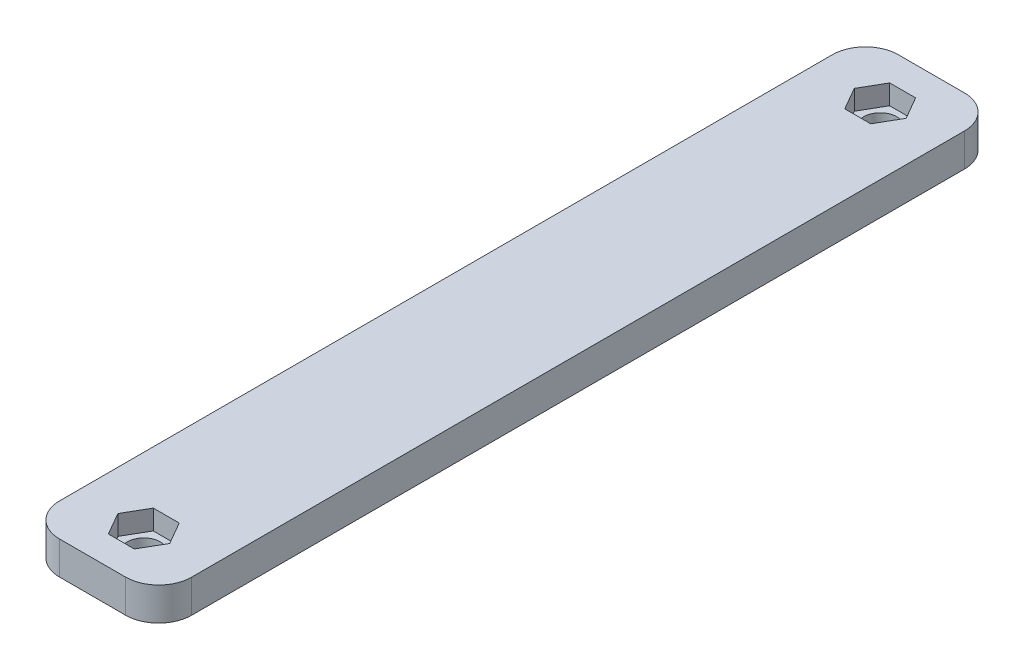
ISO-10303-21;
HEADER;
FILE_DESCRIPTION(('STEP AP214'),'2;1');
FILE_NAME('part.step','',(''),(''),'','','');
FILE_SCHEMA(('AUTOMOTIVE_DESIGN { 1 0 10303 214 1 1 1 1 }'));
ENDSEC;
DATA;
#1=APPLICATION_CONTEXT('core data for automotive mechanical design processes');
#2=APPLICATION_PROTOCOL_DEFINITION('international standard','automotive_design',2000,#1);
#3=PRODUCT_CONTEXT('',#1,'mechanical');
#4=PRODUCT('Part','Part','',(#3));
#5=PRODUCT_RELATED_PRODUCT_CATEGORY('part','',(#4));
#6=PRODUCT_DEFINITION_FORMATION('','',#4);
#7=PRODUCT_DEFINITION_CONTEXT('part definition',#1,'design');
#8=PRODUCT_DEFINITION('design','',#6,#7);
#9=PRODUCT_DEFINITION_SHAPE('','',#8);
#10=(LENGTH_UNIT() NAMED_UNIT(*) SI_UNIT(.MILLI.,.METRE.));
#11=(NAMED_UNIT(*) PLANE_ANGLE_UNIT() SI_UNIT($,.RADIAN.));
#12=(NAMED_UNIT(*) SI_UNIT($,.STERADIAN.) SOLID_ANGLE_UNIT());
#13=UNCERTAINTY_MEASURE_WITH_UNIT(LENGTH_MEASURE(1.E-05),#10,'distance_accuracy_value','');
#14=(GEOMETRIC_REPRESENTATION_CONTEXT(3) GLOBAL_UNCERTAINTY_ASSIGNED_CONTEXT((#13)) GLOBAL_UNIT_ASSIGNED_CONTEXT((#10,
#11,#12)) REPRESENTATION_CONTEXT('',''));
#15=CARTESIAN_POINT('',(0.,0.,0.));
#16=DIRECTION('',(0.,0.,1.));
#17=DIRECTION('',(1.,0.,0.));
#18=AXIS2_PLACEMENT_3D('',#15,#16,#17);
#19=CARTESIAN_POINT('',(0.,5.,0.));
#20=DIRECTION('',(0.,-1.,0.));
#21=DIRECTION('',(0.,0.,-1.));
#22=AXIS2_PLACEMENT_3D('',#19,#20,#21);
#23=PLANE('',#22);
#24=DIRECTION('',(-1.,0.,0.));
#25=VECTOR('',#24,1.);
#26=CARTESIAN_POINT('',(-10.,5.,-63.5));
#27=LINE('',#26,#25);
#28=CARTESIAN_POINT('',(5.,5.,-63.5));
#29=VERTEX_POINT('',#28);
#30=CARTESIAN_POINT('',(-5.,5.,-63.5));
#31=VERTEX_POINT('',#30);
#32=EDGE_CURVE('E335',#29,#31,#27,.T.);
#33=ORIENTED_EDGE('',*,*,#32,.T.);
#34=CARTESIAN_POINT('',(-5.,5.,-58.5));
#35=DIRECTION('',(0.,-1.,0.));
#36=DIRECTION('',(0.,0.,-1.));
#37=AXIS2_PLACEMENT_3D('',#34,#35,#36);
#38=CIRCLE('',#37,5.);
#39=CARTESIAN_POINT('',(-10.,5.,-58.5));
#40=VERTEX_POINT('',#39);
#41=EDGE_CURVE('E393',#31,#40,#38,.F.);
#42=ORIENTED_EDGE('',*,*,#41,.T.);
#43=DIRECTION('',(0.,0.,1.));
#44=VECTOR('',#43,1.);
#45=CARTESIAN_POINT('',(-10.,5.,63.5));
#46=LINE('',#45,#44);
#47=CARTESIAN_POINT('',(-10.,5.,58.5));
#48=VERTEX_POINT('',#47);
#49=EDGE_CURVE('E340',#40,#48,#46,.T.);
#50=ORIENTED_EDGE('',*,*,#49,.T.);
#51=CARTESIAN_POINT('',(-5.,5.,58.5));
#52=DIRECTION('',(0.,-1.,0.));
#53=DIRECTION('',(0.,0.,-1.));
#54=AXIS2_PLACEMENT_3D('',#51,#52,#53);
#55=CIRCLE('',#54,5.);
#56=CARTESIAN_POINT('',(-5.,5.,63.5));
#57=VERTEX_POINT('',#56);
#58=EDGE_CURVE('E60',#48,#57,#55,.F.);
#59=ORIENTED_EDGE('',*,*,#58,.T.);
#60=DIRECTION('',(1.,0.,0.));
#61=VECTOR('',#60,1.);
#62=CARTESIAN_POINT('',(-10.,5.,63.5));
#63=LINE('',#62,#61);
#64=CARTESIAN_POINT('',(5.,5.,63.5));
#65=VERTEX_POINT('',#64);
#66=EDGE_CURVE('E343',#57,#65,#63,.T.);
#67=ORIENTED_EDGE('',*,*,#66,.T.);
#68=CARTESIAN_POINT('',(5.,5.,58.5));
#69=DIRECTION('',(0.,-1.,0.));
#70=DIRECTION('',(0.,0.,-1.));
#71=AXIS2_PLACEMENT_3D('',#68,#69,#70);
#72=CIRCLE('',#71,5.);
#73=CARTESIAN_POINT('',(10.,5.,58.5));
#74=VERTEX_POINT('',#73);
#75=EDGE_CURVE('E387',#65,#74,#72,.F.);
#76=ORIENTED_EDGE('',*,*,#75,.T.);
#77=DIRECTION('',(0.,0.,-1.));
#78=VECTOR('',#77,1.);
#79=CARTESIAN_POINT('',(10.,5.,63.5));
#80=LINE('',#79,#78);
#81=CARTESIAN_POINT('',(10.,5.,-58.5));
#82=VERTEX_POINT('',#81);
#83=EDGE_CURVE('E331',#74,#82,#80,.T.);
#84=ORIENTED_EDGE('',*,*,#83,.T.);
#85=CARTESIAN_POINT('',(5.,5.,-58.5));
#86=DIRECTION('',(0.,-1.,0.));
#87=DIRECTION('',(0.,0.,-1.));
#88=AXIS2_PLACEMENT_3D('',#85,#86,#87);
#89=CIRCLE('',#88,5.);
#90=EDGE_CURVE('E390',#82,#29,#89,.F.);
#91=ORIENTED_EDGE('',*,*,#90,.T.);
#92=EDGE_LOOP('',(#33,#42,#50,#59,#67,#76,#84,#91));
#93=FACE_BOUND('',#92,.T.);
#94=DIRECTION('',(-0.5,0.,-0.866025403784439));
#95=VECTOR('',#94,1.);
#96=CARTESIAN_POINT('',(3.92598183048946,5.,-55.75));
#97=LINE('',#96,#95);
#98=CARTESIAN_POINT('',(3.92598183048946,5.,-55.75));
#99=VERTEX_POINT('',#98);
#100=CARTESIAN_POINT('',(1.96299091524473,5.,-59.15));
#101=VERTEX_POINT('',#100);
#102=EDGE_CURVE('E293',#99,#101,#97,.T.);
#103=ORIENTED_EDGE('',*,*,#102,.F.);
#104=DIRECTION('',(0.5,0.,-0.866025403784439));
#105=VECTOR('',#104,1.);
#106=CARTESIAN_POINT('',(1.96299091524473,5.,-52.35));
#107=LINE('',#106,#105);
#108=CARTESIAN_POINT('',(1.96299091524473,5.,-52.35));
#109=VERTEX_POINT('',#108);
#110=EDGE_CURVE('E261',#109,#99,#107,.T.);
#111=ORIENTED_EDGE('',*,*,#110,.F.);
#112=DIRECTION('',(1.,0.,0.));
#113=VECTOR('',#112,1.);
#114=CARTESIAN_POINT('',(-1.96299091524473,5.,-52.35));
#115=LINE('',#114,#113);
#116=CARTESIAN_POINT('',(-1.96299091524473,5.,-52.35));
#117=VERTEX_POINT('',#116);
#118=EDGE_CURVE('E270',#117,#109,#115,.T.);
#119=ORIENTED_EDGE('',*,*,#118,.F.);
#120=DIRECTION('',(0.5,0.,0.866025403784439));
#121=VECTOR('',#120,1.);
#122=CARTESIAN_POINT('',(-3.92598183048946,5.,-55.75));
#123=LINE('',#122,#121);
#124=CARTESIAN_POINT('',(-3.92598183048946,5.,-55.75));
#125=VERTEX_POINT('',#124);
#126=EDGE_CURVE('E305',#125,#117,#123,.T.);
#127=ORIENTED_EDGE('',*,*,#126,.F.);
#128=DIRECTION('',(-0.5,0.,0.866025403784439));
#129=VECTOR('',#128,1.);
#130=CARTESIAN_POINT('',(-1.96299091524473,5.,-59.15));
#131=LINE('',#130,#129);
#132=CARTESIAN_POINT('',(-1.96299091524473,5.,-59.15));
#133=VERTEX_POINT('',#132);
#134=EDGE_CURVE('E301',#133,#125,#131,.T.);
#135=ORIENTED_EDGE('',*,*,#134,.F.);
#136=DIRECTION('',(-1.,0.,0.));
#137=VECTOR('',#136,1.);
#138=CARTESIAN_POINT('',(1.96299091524473,5.,-59.15));
#139=LINE('',#138,#137);
#140=EDGE_CURVE('E297',#101,#133,#139,.T.);
#141=ORIENTED_EDGE('',*,*,#140,.F.);
#142=EDGE_LOOP('',(#103,#111,#119,#127,#135,#141));
#143=FACE_BOUND('',#142,.T.);
#144=DIRECTION('',(0.5,0.,0.866025403784439));
#145=VECTOR('',#144,1.);
#146=CARTESIAN_POINT('',(1.96299091524473,5.,52.35));
#147=LINE('',#146,#145);
#148=CARTESIAN_POINT('',(1.96299091524473,5.,52.35));
#149=VERTEX_POINT('',#148);
#150=CARTESIAN_POINT('',(3.92598183048946,5.,55.75));
#151=VERTEX_POINT('',#150);
#152=EDGE_CURVE('E198',#149,#151,#147,.T.);
#153=ORIENTED_EDGE('',*,*,#152,.T.);
#154=DIRECTION('',(-0.5,0.,0.866025403784439));
#155=VECTOR('',#154,1.);
#156=CARTESIAN_POINT('',(3.92598183048946,5.,55.75));
#157=LINE('',#156,#155);
#158=CARTESIAN_POINT('',(1.96299091524473,5.,59.15));
#159=VERTEX_POINT('',#158);
#160=EDGE_CURVE('E205',#151,#159,#157,.T.);
#161=ORIENTED_EDGE('',*,*,#160,.T.);
#162=DIRECTION('',(-1.,0.,0.));
#163=VECTOR('',#162,1.);
#164=CARTESIAN_POINT('',(1.96299091524473,5.,59.15));
#165=LINE('',#164,#163);
#166=CARTESIAN_POINT('',(-1.96299091524473,5.,59.15));
#167=VERTEX_POINT('',#166);
#168=EDGE_CURVE('E209',#159,#167,#165,.T.);
#169=ORIENTED_EDGE('',*,*,#168,.T.);
#170=DIRECTION('',(-0.5,0.,-0.866025403784439));
#171=VECTOR('',#170,1.);
#172=CARTESIAN_POINT('',(-1.96299091524473,5.,59.15));
#173=LINE('',#172,#171);
#174=CARTESIAN_POINT('',(-3.92598183048946,5.,55.75));
#175=VERTEX_POINT('',#174);
#176=EDGE_CURVE('E235',#167,#175,#173,.T.);
#177=ORIENTED_EDGE('',*,*,#176,.T.);
#178=DIRECTION('',(0.5,0.,-0.866025403784439));
#179=VECTOR('',#178,1.);
#180=CARTESIAN_POINT('',(-3.92598183048946,5.,55.75));
#181=LINE('',#180,#179);
#182=CARTESIAN_POINT('',(-1.96299091524473,5.,52.35));
#183=VERTEX_POINT('',#182);
#184=EDGE_CURVE('E231',#175,#183,#181,.T.);
#185=ORIENTED_EDGE('',*,*,#184,.T.);
#186=DIRECTION('',(1.,0.,0.));
#187=VECTOR('',#186,1.);
#188=CARTESIAN_POINT('',(-1.96299091524473,5.,52.35));
#189=LINE('',#188,#187);
#190=EDGE_CURVE('E227',#183,#149,#189,.T.);
#191=ORIENTED_EDGE('',*,*,#190,.T.);
#192=EDGE_LOOP('',(#153,#161,#169,#177,#185,#191));
#193=FACE_BOUND('',#192,.T.);
#194=ADVANCED_FACE('F39',(#93,#143,#193),#23,.F.);
#195=CARTESIAN_POINT('',(10.,5.,63.5));
#196=DIRECTION('',(-1.,0.,0.));
#197=DIRECTION('',(0.,0.,1.));
#198=AXIS2_PLACEMENT_3D('',#195,#196,#197);
#199=PLANE('',#198);
#200=DIRECTION('',(0.,0.,-1.));
#201=VECTOR('',#200,1.);
#202=CARTESIAN_POINT('',(10.,0.,63.5));
#203=LINE('',#202,#201);
#204=CARTESIAN_POINT('',(10.,0.,58.5));
#205=VERTEX_POINT('',#204);
#206=CARTESIAN_POINT('',(10.,0.,-58.5));
#207=VERTEX_POINT('',#206);
#208=EDGE_CURVE('E315',#205,#207,#203,.T.);
#209=ORIENTED_EDGE('',*,*,#208,.T.);
#210=DIRECTION('',(0.,-1.,0.));
#211=VECTOR('',#210,1.);
#212=CARTESIAN_POINT('',(10.,5.,-58.5));
#213=LINE('',#212,#211);
#214=EDGE_CURVE('E400',#207,#82,#213,.F.);
#215=ORIENTED_EDGE('',*,*,#214,.T.);
#216=ORIENTED_EDGE('',*,*,#83,.F.);
#217=DIRECTION('',(0.,-1.,0.));
#218=VECTOR('',#217,1.);
#219=CARTESIAN_POINT('',(10.,5.,58.5));
#220=LINE('',#219,#218);
#221=EDGE_CURVE('E396',#74,#205,#220,.T.);
#222=ORIENTED_EDGE('',*,*,#221,.T.);
#223=EDGE_LOOP('',(#209,#215,#216,#222));
#224=FACE_BOUND('',#223,.T.);
#225=ADVANCED_FACE('F418',(#224),#199,.F.);
#226=CARTESIAN_POINT('',(-10.,5.,-63.5));
#227=DIRECTION('',(0.,0.,1.));
#228=DIRECTION('',(1.,0.,0.));
#229=AXIS2_PLACEMENT_3D('',#226,#227,#228);
#230=PLANE('',#229);
#231=DIRECTION('',(-1.,0.,0.));
#232=VECTOR('',#231,1.);
#233=CARTESIAN_POINT('',(-10.,0.,-63.5));
#234=LINE('',#233,#232);
#235=CARTESIAN_POINT('',(5.,0.,-63.5));
#236=VERTEX_POINT('',#235);
#237=CARTESIAN_POINT('',(-5.,0.,-63.5));
#238=VERTEX_POINT('',#237);
#239=EDGE_CURVE('E350',#236,#238,#234,.T.);
#240=ORIENTED_EDGE('',*,*,#239,.T.);
#241=DIRECTION('',(0.,-1.,0.));
#242=VECTOR('',#241,1.);
#243=CARTESIAN_POINT('',(-5.,5.,-63.5));
#244=LINE('',#243,#242);
#245=EDGE_CURVE('E382',#238,#31,#244,.F.);
#246=ORIENTED_EDGE('',*,*,#245,.T.);
#247=ORIENTED_EDGE('',*,*,#32,.F.);
#248=DIRECTION('',(0.,-1.,0.));
#249=VECTOR('',#248,1.);
#250=CARTESIAN_POINT('',(5.,5.,-63.5));
#251=LINE('',#250,#249);
#252=EDGE_CURVE('E378',#29,#236,#251,.T.);
#253=ORIENTED_EDGE('',*,*,#252,.T.);
#254=EDGE_LOOP('',(#240,#246,#247,#253));
#255=FACE_BOUND('',#254,.T.);
#256=ADVANCED_FACE('F428',(#255),#230,.F.);
#257=CARTESIAN_POINT('',(-10.,5.,63.5));
#258=DIRECTION('',(1.,0.,0.));
#259=DIRECTION('',(0.,0.,-1.));
#260=AXIS2_PLACEMENT_3D('',#257,#258,#259);
#261=PLANE('',#260);
#262=ORIENTED_EDGE('',*,*,#49,.F.);
#263=DIRECTION('',(0.,-1.,0.));
#264=VECTOR('',#263,1.);
#265=CARTESIAN_POINT('',(-10.,5.,-58.5));
#266=LINE('',#265,#264);
#267=CARTESIAN_POINT('',(-10.,0.,-58.5));
#268=VERTEX_POINT('',#267);
#269=EDGE_CURVE('E362',#40,#268,#266,.T.);
#270=ORIENTED_EDGE('',*,*,#269,.T.);
#271=DIRECTION('',(0.,0.,1.));
#272=VECTOR('',#271,1.);
#273=CARTESIAN_POINT('',(-10.,0.,63.5));
#274=LINE('',#273,#272);
#275=CARTESIAN_POINT('',(-10.,0.,58.5));
#276=VERTEX_POINT('',#275);
#277=EDGE_CURVE('E354',#268,#276,#274,.T.);
#278=ORIENTED_EDGE('',*,*,#277,.T.);
#279=DIRECTION('',(0.,-1.,0.));
#280=VECTOR('',#279,1.);
#281=CARTESIAN_POINT('',(-10.,5.,58.5));
#282=LINE('',#281,#280);
#283=EDGE_CURVE('E346',#276,#48,#282,.F.);
#284=ORIENTED_EDGE('',*,*,#283,.T.);
#285=EDGE_LOOP('',(#262,#270,#278,#284));
#286=FACE_BOUND('',#285,.T.);
#287=ADVANCED_FACE('F436',(#286),#261,.F.);
#288=CARTESIAN_POINT('',(-10.,5.,63.5));
#289=DIRECTION('',(0.,0.,-1.));
#290=DIRECTION('',(-1.,0.,0.));
#291=AXIS2_PLACEMENT_3D('',#288,#289,#290);
#292=PLANE('',#291);
#293=DIRECTION('',(1.,0.,0.));
#294=VECTOR('',#293,1.);
#295=CARTESIAN_POINT('',(-10.,0.,63.5));
#296=LINE('',#295,#294);
#297=CARTESIAN_POINT('',(-5.,0.,63.5));
#298=VERTEX_POINT('',#297);
#299=CARTESIAN_POINT('',(5.,0.,63.5));
#300=VERTEX_POINT('',#299);
#301=EDGE_CURVE('E336',#298,#300,#296,.T.);
#302=ORIENTED_EDGE('',*,*,#301,.T.);
#303=DIRECTION('',(0.,-1.,0.));
#304=VECTOR('',#303,1.);
#305=CARTESIAN_POINT('',(5.,5.,63.5));
#306=LINE('',#305,#304);
#307=EDGE_CURVE('E11',#300,#65,#306,.F.);
#308=ORIENTED_EDGE('',*,*,#307,.T.);
#309=ORIENTED_EDGE('',*,*,#66,.F.);
#310=DIRECTION('',(0.,-1.,0.));
#311=VECTOR('',#310,1.);
#312=CARTESIAN_POINT('',(-5.,5.,63.5));
#313=LINE('',#312,#311);
#314=EDGE_CURVE('E48',#57,#298,#313,.T.);
#315=ORIENTED_EDGE('',*,*,#314,.T.);
#316=EDGE_LOOP('',(#302,#308,#309,#315));
#317=FACE_BOUND('',#316,.T.);
#318=ADVANCED_FACE('F406',(#317),#292,.F.);
#319=CARTESIAN_POINT('',(0.,0.,0.));
#320=DIRECTION('',(0.,-1.,0.));
#321=DIRECTION('',(0.,0.,-1.));
#322=AXIS2_PLACEMENT_3D('',#319,#320,#321);
#323=PLANE('',#322);
#324=CARTESIAN_POINT('',(0.,0.,55.75));
#325=DIRECTION('',(0.,-1.,0.));
#326=DIRECTION('',(0.,0.,-1.));
#327=AXIS2_PLACEMENT_3D('',#324,#325,#326);
#328=CIRCLE('',#327,2.5);
#329=CARTESIAN_POINT('',(0.,0.,53.25));
#330=VERTEX_POINT('',#329);
#331=EDGE_CURVE('E228',#330,#330,#328,.T.);
#332=ORIENTED_EDGE('',*,*,#331,.F.);
#333=EDGE_LOOP('',(#332));
#334=FACE_BOUND('',#333,.T.);
#335=CARTESIAN_POINT('',(0.,0.,-55.75));
#336=DIRECTION('',(0.,1.,0.));
#337=DIRECTION('',(0.,0.,1.));
#338=AXIS2_PLACEMENT_3D('',#335,#336,#337);
#339=CIRCLE('',#338,2.5);
#340=CARTESIAN_POINT('',(0.,0.,-53.25));
#341=VERTEX_POINT('',#340);
#342=EDGE_CURVE('E257',#341,#341,#339,.T.);
#343=ORIENTED_EDGE('',*,*,#342,.T.);
#344=EDGE_LOOP('',(#343));
#345=FACE_BOUND('',#344,.T.);
#346=ORIENTED_EDGE('',*,*,#277,.F.);
#347=CARTESIAN_POINT('',(-5.,0.,-58.5));
#348=DIRECTION('',(0.,-1.,0.));
#349=DIRECTION('',(0.,0.,-1.));
#350=AXIS2_PLACEMENT_3D('',#347,#348,#349);
#351=CIRCLE('',#350,5.);
#352=EDGE_CURVE('E375',#268,#238,#351,.T.);
#353=ORIENTED_EDGE('',*,*,#352,.T.);
#354=ORIENTED_EDGE('',*,*,#239,.F.);
#355=CARTESIAN_POINT('',(5.,0.,-58.5));
#356=DIRECTION('',(0.,-1.,0.));
#357=DIRECTION('',(0.,0.,-1.));
#358=AXIS2_PLACEMENT_3D('',#355,#356,#357);
#359=CIRCLE('',#358,5.);
#360=EDGE_CURVE('E372',#236,#207,#359,.T.);
#361=ORIENTED_EDGE('',*,*,#360,.T.);
#362=ORIENTED_EDGE('',*,*,#208,.F.);
#363=CARTESIAN_POINT('',(5.,0.,58.5));
#364=DIRECTION('',(0.,-1.,0.));
#365=DIRECTION('',(0.,0.,-1.));
#366=AXIS2_PLACEMENT_3D('',#363,#364,#365);
#367=CIRCLE('',#366,5.);
#368=EDGE_CURVE('E369',#205,#300,#367,.T.);
#369=ORIENTED_EDGE('',*,*,#368,.T.);
#370=ORIENTED_EDGE('',*,*,#301,.F.);
#371=CARTESIAN_POINT('',(-5.,0.,58.5));
#372=DIRECTION('',(0.,-1.,0.));
#373=DIRECTION('',(0.,0.,-1.));
#374=AXIS2_PLACEMENT_3D('',#371,#372,#373);
#375=CIRCLE('',#374,5.);
#376=EDGE_CURVE('E366',#298,#276,#375,.T.);
#377=ORIENTED_EDGE('',*,*,#376,.T.);
#378=EDGE_LOOP('',(#346,#353,#354,#361,#362,#369,#370,#377));
#379=FACE_BOUND('',#378,.T.);
#380=ADVANCED_FACE('F410',(#334,#345,#379),#323,.T.);
#381=CARTESIAN_POINT('',(1.96299091524473,2.,-52.35));
#382=DIRECTION('',(0.866025403784439,0.,0.5));
#383=DIRECTION('',(0.5,0.,-0.866025403784439));
#384=AXIS2_PLACEMENT_3D('',#381,#382,#383);
#385=PLANE('',#384);
#386=ORIENTED_EDGE('',*,*,#110,.T.);
#387=DIRECTION('',(0.,1.,0.));
#388=VECTOR('',#387,1.);
#389=CARTESIAN_POINT('',(3.92598183048946,2.,-55.75));
#390=LINE('',#389,#388);
#391=CARTESIAN_POINT('',(3.92598183048946,2.,-55.75));
#392=VERTEX_POINT('',#391);
#393=EDGE_CURVE('E290',#392,#99,#390,.T.);
#394=ORIENTED_EDGE('',*,*,#393,.F.);
#395=DIRECTION('',(0.5,0.,-0.866025403784439));
#396=VECTOR('',#395,1.);
#397=CARTESIAN_POINT('',(1.96299091524473,2.,-52.35));
#398=LINE('',#397,#396);
#399=CARTESIAN_POINT('',(1.96299091524473,2.,-52.35));
#400=VERTEX_POINT('',#399);
#401=EDGE_CURVE('E265',#400,#392,#398,.T.);
#402=ORIENTED_EDGE('',*,*,#401,.F.);
#403=DIRECTION('',(0.,1.,0.));
#404=VECTOR('',#403,1.);
#405=CARTESIAN_POINT('',(1.96299091524473,2.,-52.35));
#406=LINE('',#405,#404);
#407=EDGE_CURVE('E312',#400,#109,#406,.T.);
#408=ORIENTED_EDGE('',*,*,#407,.T.);
#409=EDGE_LOOP('',(#386,#394,#402,#408));
#410=FACE_BOUND('',#409,.T.);
#411=ADVANCED_FACE('F450',(#410),#385,.F.);
#412=CARTESIAN_POINT('',(-1.96299091524473,2.,-52.35));
#413=DIRECTION('',(0.,0.,1.));
#414=DIRECTION('',(1.,0.,0.));
#415=AXIS2_PLACEMENT_3D('',#412,#413,#414);
#416=PLANE('',#415);
#417=ORIENTED_EDGE('',*,*,#118,.T.);
#418=ORIENTED_EDGE('',*,*,#407,.F.);
#419=DIRECTION('',(1.,0.,0.));
#420=VECTOR('',#419,1.);
#421=CARTESIAN_POINT('',(-1.96299091524473,2.,-52.35));
#422=LINE('',#421,#420);
#423=CARTESIAN_POINT('',(-1.96299091524473,2.,-52.35));
#424=VERTEX_POINT('',#423);
#425=EDGE_CURVE('E286',#424,#400,#422,.T.);
#426=ORIENTED_EDGE('',*,*,#425,.F.);
#427=DIRECTION('',(0.,1.,0.));
#428=VECTOR('',#427,1.);
#429=CARTESIAN_POINT('',(-1.96299091524473,2.,-52.35));
#430=LINE('',#429,#428);
#431=EDGE_CURVE('E316',#424,#117,#430,.T.);
#432=ORIENTED_EDGE('',*,*,#431,.T.);
#433=EDGE_LOOP('',(#417,#418,#426,#432));
#434=FACE_BOUND('',#433,.T.);
#435=ADVANCED_FACE('F610',(#434),#416,.F.);
#436=CARTESIAN_POINT('',(-3.92598183048946,2.,-55.75));
#437=DIRECTION('',(-0.866025403784439,0.,0.5));
#438=DIRECTION('',(0.5,0.,0.866025403784439));
#439=AXIS2_PLACEMENT_3D('',#436,#437,#438);
#440=PLANE('',#439);
#441=ORIENTED_EDGE('',*,*,#126,.T.);
#442=ORIENTED_EDGE('',*,*,#431,.F.);
#443=DIRECTION('',(0.5,0.,0.866025403784439));
#444=VECTOR('',#443,1.);
#445=CARTESIAN_POINT('',(-3.92598183048946,2.,-55.75));
#446=LINE('',#445,#444);
#447=CARTESIAN_POINT('',(-3.92598183048946,2.,-55.75));
#448=VERTEX_POINT('',#447);
#449=EDGE_CURVE('E282',#448,#424,#446,.T.);
#450=ORIENTED_EDGE('',*,*,#449,.F.);
#451=DIRECTION('',(0.,1.,0.));
#452=VECTOR('',#451,1.);
#453=CARTESIAN_POINT('',(-3.92598183048946,2.,-55.75));
#454=LINE('',#453,#452);
#455=EDGE_CURVE('E319',#448,#125,#454,.T.);
#456=ORIENTED_EDGE('',*,*,#455,.T.);
#457=EDGE_LOOP('',(#441,#442,#450,#456));
#458=FACE_BOUND('',#457,.T.);
#459=ADVANCED_FACE('F601',(#458),#440,.F.);
#460=CARTESIAN_POINT('',(-1.96299091524473,2.,-59.15));
#461=DIRECTION('',(-0.866025403784439,0.,-0.5));
#462=DIRECTION('',(-0.5,0.,0.866025403784439));
#463=AXIS2_PLACEMENT_3D('',#460,#461,#462);
#464=PLANE('',#463);
#465=ORIENTED_EDGE('',*,*,#134,.T.);
#466=ORIENTED_EDGE('',*,*,#455,.F.);
#467=DIRECTION('',(-0.5,0.,0.866025403784439));
#468=VECTOR('',#467,1.);
#469=CARTESIAN_POINT('',(-1.96299091524473,2.,-59.15));
#470=LINE('',#469,#468);
#471=CARTESIAN_POINT('',(-1.96299091524473,2.,-59.15));
#472=VERTEX_POINT('',#471);
#473=EDGE_CURVE('E278',#472,#448,#470,.T.);
#474=ORIENTED_EDGE('',*,*,#473,.F.);
#475=DIRECTION('',(0.,1.,0.));
#476=VECTOR('',#475,1.);
#477=CARTESIAN_POINT('',(-1.96299091524473,2.,-59.15));
#478=LINE('',#477,#476);
#479=EDGE_CURVE('E322',#472,#133,#478,.T.);
#480=ORIENTED_EDGE('',*,*,#479,.T.);
#481=EDGE_LOOP('',(#465,#466,#474,#480));
#482=FACE_BOUND('',#481,.T.);
#483=ADVANCED_FACE('F592',(#482),#464,.F.);
#484=CARTESIAN_POINT('',(1.96299091524473,2.,-59.15));
#485=DIRECTION('',(0.,0.,-1.));
#486=DIRECTION('',(-1.,0.,0.));
#487=AXIS2_PLACEMENT_3D('',#484,#485,#486);
#488=PLANE('',#487);
#489=ORIENTED_EDGE('',*,*,#140,.T.);
#490=ORIENTED_EDGE('',*,*,#479,.F.);
#491=DIRECTION('',(-1.,0.,0.));
#492=VECTOR('',#491,1.);
#493=CARTESIAN_POINT('',(1.96299091524473,2.,-59.15));
#494=LINE('',#493,#492);
#495=CARTESIAN_POINT('',(1.96299091524473,2.,-59.15));
#496=VERTEX_POINT('',#495);
#497=EDGE_CURVE('E274',#496,#472,#494,.T.);
#498=ORIENTED_EDGE('',*,*,#497,.F.);
#499=DIRECTION('',(0.,1.,0.));
#500=VECTOR('',#499,1.);
#501=CARTESIAN_POINT('',(1.96299091524473,2.,-59.15));
#502=LINE('',#501,#500);
#503=EDGE_CURVE('E325',#496,#101,#502,.T.);
#504=ORIENTED_EDGE('',*,*,#503,.T.);
#505=EDGE_LOOP('',(#489,#490,#498,#504));
#506=FACE_BOUND('',#505,.T.);
#507=ADVANCED_FACE('F584',(#506),#488,.F.);
#508=CARTESIAN_POINT('',(3.92598183048946,2.,-55.75));
#509=DIRECTION('',(0.866025403784439,0.,-0.5));
#510=DIRECTION('',(-0.5,0.,-0.866025403784439));
#511=AXIS2_PLACEMENT_3D('',#508,#509,#510);
#512=PLANE('',#511);
#513=ORIENTED_EDGE('',*,*,#102,.T.);
#514=ORIENTED_EDGE('',*,*,#503,.F.);
#515=DIRECTION('',(-0.5,0.,-0.866025403784439));
#516=VECTOR('',#515,1.);
#517=CARTESIAN_POINT('',(3.92598183048946,2.,-55.75));
#518=LINE('',#517,#516);
#519=EDGE_CURVE('E269',#392,#496,#518,.T.);
#520=ORIENTED_EDGE('',*,*,#519,.F.);
#521=ORIENTED_EDGE('',*,*,#393,.T.);
#522=EDGE_LOOP('',(#513,#514,#520,#521));
#523=FACE_BOUND('',#522,.T.);
#524=ADVANCED_FACE('F575',(#523),#512,.F.);
#525=CARTESIAN_POINT('',(0.,2.,0.));
#526=DIRECTION('',(0.,1.,0.));
#527=DIRECTION('',(0.,0.,1.));
#528=AXIS2_PLACEMENT_3D('',#525,#526,#527);
#529=PLANE('',#528);
#530=CARTESIAN_POINT('',(0.,2.,-55.75));
#531=DIRECTION('',(0.,1.,0.));
#532=DIRECTION('',(0.,0.,1.));
#533=AXIS2_PLACEMENT_3D('',#530,#531,#532);
#534=CIRCLE('',#533,2.5);
#535=CARTESIAN_POINT('',(0.,2.,-53.25));
#536=VERTEX_POINT('',#535);
#537=EDGE_CURVE('E245',#536,#536,#534,.T.);
#538=ORIENTED_EDGE('',*,*,#537,.F.);
#539=EDGE_LOOP('',(#538));
#540=FACE_BOUND('',#539,.T.);
#541=ORIENTED_EDGE('',*,*,#401,.T.);
#542=ORIENTED_EDGE('',*,*,#519,.T.);
#543=ORIENTED_EDGE('',*,*,#497,.T.);
#544=ORIENTED_EDGE('',*,*,#473,.T.);
#545=ORIENTED_EDGE('',*,*,#449,.T.);
#546=ORIENTED_EDGE('',*,*,#425,.T.);
#547=EDGE_LOOP('',(#541,#542,#543,#544,#545,#546));
#548=FACE_BOUND('',#547,.T.);
#549=ADVANCED_FACE('F566',(#540,#548),#529,.T.);
#550=CARTESIAN_POINT('',(0.,0.,-55.75));
#551=DIRECTION('',(0.,1.,0.));
#552=DIRECTION('',(0.,0.,1.));
#553=AXIS2_PLACEMENT_3D('',#550,#551,#552);
#554=CYLINDRICAL_SURFACE('',#553,2.5);
#555=ORIENTED_EDGE('',*,*,#342,.F.);
#556=EDGE_LOOP('',(#555));
#557=FACE_BOUND('',#556,.T.);
#558=ORIENTED_EDGE('',*,*,#537,.T.);
#559=EDGE_LOOP('',(#558));
#560=FACE_BOUND('',#559,.T.);
#561=ADVANCED_FACE('F553',(#557,#560),#554,.F.);
#562=CARTESIAN_POINT('',(1.96299091524473,2.,52.35));
#563=DIRECTION('',(-0.866025403784439,0.,0.5));
#564=DIRECTION('',(0.5,0.,0.866025403784439));
#565=AXIS2_PLACEMENT_3D('',#562,#563,#564);
#566=PLANE('',#565);
#567=ORIENTED_EDGE('',*,*,#152,.F.);
#568=DIRECTION('',(0.,1.,0.));
#569=VECTOR('',#568,1.);
#570=CARTESIAN_POINT('',(1.96299091524473,2.,52.35));
#571=LINE('',#570,#569);
#572=CARTESIAN_POINT('',(1.96299091524473,2.,52.35));
#573=VERTEX_POINT('',#572);
#574=EDGE_CURVE('E182',#573,#149,#571,.T.);
#575=ORIENTED_EDGE('',*,*,#574,.F.);
#576=DIRECTION('',(0.5,0.,0.866025403784439));
#577=VECTOR('',#576,1.);
#578=CARTESIAN_POINT('',(1.96299091524473,2.,52.35));
#579=LINE('',#578,#577);
#580=CARTESIAN_POINT('',(3.92598183048946,2.,55.75));
#581=VERTEX_POINT('',#580);
#582=EDGE_CURVE('E190',#573,#581,#579,.T.);
#583=ORIENTED_EDGE('',*,*,#582,.T.);
#584=DIRECTION('',(0.,1.,0.));
#585=VECTOR('',#584,1.);
#586=CARTESIAN_POINT('',(3.92598183048946,2.,55.75));
#587=LINE('',#586,#585);
#588=EDGE_CURVE('E242',#581,#151,#587,.T.);
#589=ORIENTED_EDGE('',*,*,#588,.T.);
#590=EDGE_LOOP('',(#567,#575,#583,#589));
#591=FACE_BOUND('',#590,.T.);
#592=ADVANCED_FACE('F194',(#591),#566,.T.);
#593=CARTESIAN_POINT('',(3.92598183048946,2.,55.75));
#594=DIRECTION('',(-0.866025403784439,0.,-0.5));
#595=DIRECTION('',(-0.5,0.,0.866025403784439));
#596=AXIS2_PLACEMENT_3D('',#593,#594,#595);
#597=PLANE('',#596);
#598=ORIENTED_EDGE('',*,*,#160,.F.);
#599=ORIENTED_EDGE('',*,*,#588,.F.);
#600=DIRECTION('',(-0.5,0.,0.866025403784439));
#601=VECTOR('',#600,1.);
#602=CARTESIAN_POINT('',(3.92598183048946,2.,55.75));
#603=LINE('',#602,#601);
#604=CARTESIAN_POINT('',(1.96299091524473,2.,59.15));
#605=VERTEX_POINT('',#604);
#606=EDGE_CURVE('E200',#581,#605,#603,.T.);
#607=ORIENTED_EDGE('',*,*,#606,.T.);
#608=DIRECTION('',(0.,1.,0.));
#609=VECTOR('',#608,1.);
#610=CARTESIAN_POINT('',(1.96299091524473,2.,59.15));
#611=LINE('',#610,#609);
#612=EDGE_CURVE('E246',#605,#159,#611,.T.);
#613=ORIENTED_EDGE('',*,*,#612,.T.);
#614=EDGE_LOOP('',(#598,#599,#607,#613));
#615=FACE_BOUND('',#614,.T.);
#616=ADVANCED_FACE('F536',(#615),#597,.T.);
#617=CARTESIAN_POINT('',(1.96299091524473,2.,59.15));
#618=DIRECTION('',(0.,0.,-1.));
#619=DIRECTION('',(-1.,0.,0.));
#620=AXIS2_PLACEMENT_3D('',#617,#618,#619);
#621=PLANE('',#620);
#622=ORIENTED_EDGE('',*,*,#168,.F.);
#623=ORIENTED_EDGE('',*,*,#612,.F.);
#624=DIRECTION('',(-1.,0.,0.));
#625=VECTOR('',#624,1.);
#626=CARTESIAN_POINT('',(1.96299091524473,2.,59.15));
#627=LINE('',#626,#625);
#628=CARTESIAN_POINT('',(-1.96299091524473,2.,59.15));
#629=VERTEX_POINT('',#628);
#630=EDGE_CURVE('E220',#605,#629,#627,.T.);
#631=ORIENTED_EDGE('',*,*,#630,.T.);
#632=DIRECTION('',(0.,1.,0.));
#633=VECTOR('',#632,1.);
#634=CARTESIAN_POINT('',(-1.96299091524473,2.,59.15));
#635=LINE('',#634,#633);
#636=EDGE_CURVE('E249',#629,#167,#635,.T.);
#637=ORIENTED_EDGE('',*,*,#636,.T.);
#638=EDGE_LOOP('',(#622,#623,#631,#637));
#639=FACE_BOUND('',#638,.T.);
#640=ADVANCED_FACE('F527',(#639),#621,.T.);
#641=CARTESIAN_POINT('',(-1.96299091524473,2.,59.15));
#642=DIRECTION('',(0.866025403784439,0.,-0.5));
#643=DIRECTION('',(-0.5,0.,-0.866025403784439));
#644=AXIS2_PLACEMENT_3D('',#641,#642,#643);
#645=PLANE('',#644);
#646=ORIENTED_EDGE('',*,*,#176,.F.);
#647=ORIENTED_EDGE('',*,*,#636,.F.);
#648=DIRECTION('',(-0.5,0.,-0.866025403784439));
#649=VECTOR('',#648,1.);
#650=CARTESIAN_POINT('',(-1.96299091524473,2.,59.15));
#651=LINE('',#650,#649);
#652=CARTESIAN_POINT('',(-3.92598183048946,2.,55.75));
#653=VERTEX_POINT('',#652);
#654=EDGE_CURVE('E217',#629,#653,#651,.T.);
#655=ORIENTED_EDGE('',*,*,#654,.T.);
#656=DIRECTION('',(0.,1.,0.));
#657=VECTOR('',#656,1.);
#658=CARTESIAN_POINT('',(-3.92598183048946,2.,55.75));
#659=LINE('',#658,#657);
#660=EDGE_CURVE('E252',#653,#175,#659,.T.);
#661=ORIENTED_EDGE('',*,*,#660,.T.);
#662=EDGE_LOOP('',(#646,#647,#655,#661));
#663=FACE_BOUND('',#662,.T.);
#664=ADVANCED_FACE('F518',(#663),#645,.T.);
#665=CARTESIAN_POINT('',(-3.92598183048946,2.,55.75));
#666=DIRECTION('',(0.866025403784439,0.,0.5));
#667=DIRECTION('',(0.5,0.,-0.866025403784439));
#668=AXIS2_PLACEMENT_3D('',#665,#666,#667);
#669=PLANE('',#668);
#670=ORIENTED_EDGE('',*,*,#184,.F.);
#671=ORIENTED_EDGE('',*,*,#660,.F.);
#672=DIRECTION('',(0.5,0.,-0.866025403784439));
#673=VECTOR('',#672,1.);
#674=CARTESIAN_POINT('',(-3.92598183048946,2.,55.75));
#675=LINE('',#674,#673);
#676=CARTESIAN_POINT('',(-1.96299091524473,2.,52.35));
#677=VERTEX_POINT('',#676);
#678=EDGE_CURVE('E189',#653,#677,#675,.T.);
#679=ORIENTED_EDGE('',*,*,#678,.T.);
#680=DIRECTION('',(0.,1.,0.));
#681=VECTOR('',#680,1.);
#682=CARTESIAN_POINT('',(-1.96299091524473,2.,52.35));
#683=LINE('',#682,#681);
#684=EDGE_CURVE('E184',#677,#183,#683,.T.);
#685=ORIENTED_EDGE('',*,*,#684,.T.);
#686=EDGE_LOOP('',(#670,#671,#679,#685));
#687=FACE_BOUND('',#686,.T.);
#688=ADVANCED_FACE('F510',(#687),#669,.T.);
#689=CARTESIAN_POINT('',(-1.96299091524473,2.,52.35));
#690=DIRECTION('',(0.,0.,1.));
#691=DIRECTION('',(1.,0.,0.));
#692=AXIS2_PLACEMENT_3D('',#689,#690,#691);
#693=PLANE('',#692);
#694=ORIENTED_EDGE('',*,*,#190,.F.);
#695=ORIENTED_EDGE('',*,*,#684,.F.);
#696=DIRECTION('',(1.,0.,0.));
#697=VECTOR('',#696,1.);
#698=CARTESIAN_POINT('',(-1.96299091524473,2.,52.35));
#699=LINE('',#698,#697);
#700=EDGE_CURVE('E178',#677,#573,#699,.T.);
#701=ORIENTED_EDGE('',*,*,#700,.T.);
#702=ORIENTED_EDGE('',*,*,#574,.T.);
#703=EDGE_LOOP('',(#694,#695,#701,#702));
#704=FACE_BOUND('',#703,.T.);
#705=ADVANCED_FACE('F181',(#704),#693,.T.);
#706=CARTESIAN_POINT('',(0.,2.,0.));
#707=DIRECTION('',(0.,1.,0.));
#708=DIRECTION('',(0.,0.,-1.));
#709=AXIS2_PLACEMENT_3D('',#706,#707,#708);
#710=PLANE('',#709);
#711=CARTESIAN_POINT('',(0.,2.,55.75));
#712=DIRECTION('',(0.,-1.,0.));
#713=DIRECTION('',(0.,0.,-1.));
#714=AXIS2_PLACEMENT_3D('',#711,#712,#713);
#715=CIRCLE('',#714,2.5);
#716=CARTESIAN_POINT('',(0.,2.,53.25));
#717=VERTEX_POINT('',#716);
#718=EDGE_CURVE('E212',#717,#717,#715,.T.);
#719=ORIENTED_EDGE('',*,*,#718,.T.);
#720=EDGE_LOOP('',(#719));
#721=FACE_BOUND('',#720,.T.);
#722=ORIENTED_EDGE('',*,*,#582,.F.);
#723=ORIENTED_EDGE('',*,*,#700,.F.);
#724=ORIENTED_EDGE('',*,*,#678,.F.);
#725=ORIENTED_EDGE('',*,*,#654,.F.);
#726=ORIENTED_EDGE('',*,*,#630,.F.);
#727=ORIENTED_EDGE('',*,*,#606,.F.);
#728=EDGE_LOOP('',(#722,#723,#724,#725,#726,#727));
#729=FACE_BOUND('',#728,.T.);
#730=ADVANCED_FACE('F202',(#721,#729),#710,.T.);
#731=CARTESIAN_POINT('',(0.,0.,55.75));
#732=DIRECTION('',(0.,1.,0.));
#733=DIRECTION('',(0.,0.,1.));
#734=AXIS2_PLACEMENT_3D('',#731,#732,#733);
#735=CYLINDRICAL_SURFACE('',#734,2.5);
#736=ORIENTED_EDGE('',*,*,#331,.T.);
#737=EDGE_LOOP('',(#736));
#738=FACE_BOUND('',#737,.T.);
#739=ORIENTED_EDGE('',*,*,#718,.F.);
#740=EDGE_LOOP('',(#739));
#741=FACE_BOUND('',#740,.T.);
#742=ADVANCED_FACE('F463',(#738,#741),#735,.F.);
#743=CARTESIAN_POINT('',(-5.,5.,-58.5));
#744=DIRECTION('',(0.,-1.,0.));
#745=DIRECTION('',(0.,0.,-1.));
#746=AXIS2_PLACEMENT_3D('',#743,#744,#745);
#747=CYLINDRICAL_SURFACE('',#746,5.);
#748=ORIENTED_EDGE('',*,*,#41,.F.);
#749=ORIENTED_EDGE('',*,*,#245,.F.);
#750=ORIENTED_EDGE('',*,*,#352,.F.);
#751=ORIENTED_EDGE('',*,*,#269,.F.);
#752=EDGE_LOOP('',(#748,#749,#750,#751));
#753=FACE_BOUND('',#752,.T.);
#754=ADVANCED_FACE('F433',(#753),#747,.T.);
#755=CARTESIAN_POINT('',(5.,5.,-58.5));
#756=DIRECTION('',(0.,-1.,0.));
#757=DIRECTION('',(0.,0.,-1.));
#758=AXIS2_PLACEMENT_3D('',#755,#756,#757);
#759=CYLINDRICAL_SURFACE('',#758,5.);
#760=ORIENTED_EDGE('',*,*,#90,.F.);
#761=ORIENTED_EDGE('',*,*,#214,.F.);
#762=ORIENTED_EDGE('',*,*,#360,.F.);
#763=ORIENTED_EDGE('',*,*,#252,.F.);
#764=EDGE_LOOP('',(#760,#761,#762,#763));
#765=FACE_BOUND('',#764,.T.);
#766=ADVANCED_FACE('F425',(#765),#759,.T.);
#767=CARTESIAN_POINT('',(5.,5.,58.5));
#768=DIRECTION('',(0.,-1.,0.));
#769=DIRECTION('',(0.,0.,-1.));
#770=AXIS2_PLACEMENT_3D('',#767,#768,#769);
#771=CYLINDRICAL_SURFACE('',#770,5.);
#772=ORIENTED_EDGE('',*,*,#75,.F.);
#773=ORIENTED_EDGE('',*,*,#307,.F.);
#774=ORIENTED_EDGE('',*,*,#368,.F.);
#775=ORIENTED_EDGE('',*,*,#221,.F.);
#776=EDGE_LOOP('',(#772,#773,#774,#775));
#777=FACE_BOUND('',#776,.T.);
#778=ADVANCED_FACE('F415',(#777),#771,.T.);
#779=CARTESIAN_POINT('',(-5.,5.,58.5));
#780=DIRECTION('',(0.,-1.,0.));
#781=DIRECTION('',(0.,0.,-1.));
#782=AXIS2_PLACEMENT_3D('',#779,#780,#781);
#783=CYLINDRICAL_SURFACE('',#782,5.);
#784=ORIENTED_EDGE('',*,*,#58,.F.);
#785=ORIENTED_EDGE('',*,*,#283,.F.);
#786=ORIENTED_EDGE('',*,*,#376,.F.);
#787=ORIENTED_EDGE('',*,*,#314,.F.);
#788=EDGE_LOOP('',(#784,#785,#786,#787));
#789=FACE_BOUND('',#788,.T.);
#790=ADVANCED_FACE('F41',(#789),#783,.T.);
#791=CLOSED_SHELL('',(#194,#225,#256,#287,#318,#380,#411,#435,#459,#483,#507,#524,#549,#561,
#592,#616,#640,#664,#688,#705,#730,#742,#754,#766,#778,#790));
#792=MANIFOLD_SOLID_BREP('B2',#791);
#793=ADVANCED_BREP_SHAPE_REPRESENTATION('',(#18,#792),#14);
#794=SHAPE_DEFINITION_REPRESENTATION(#9,#793);
ENDSEC;
END-ISO-10303-21;
